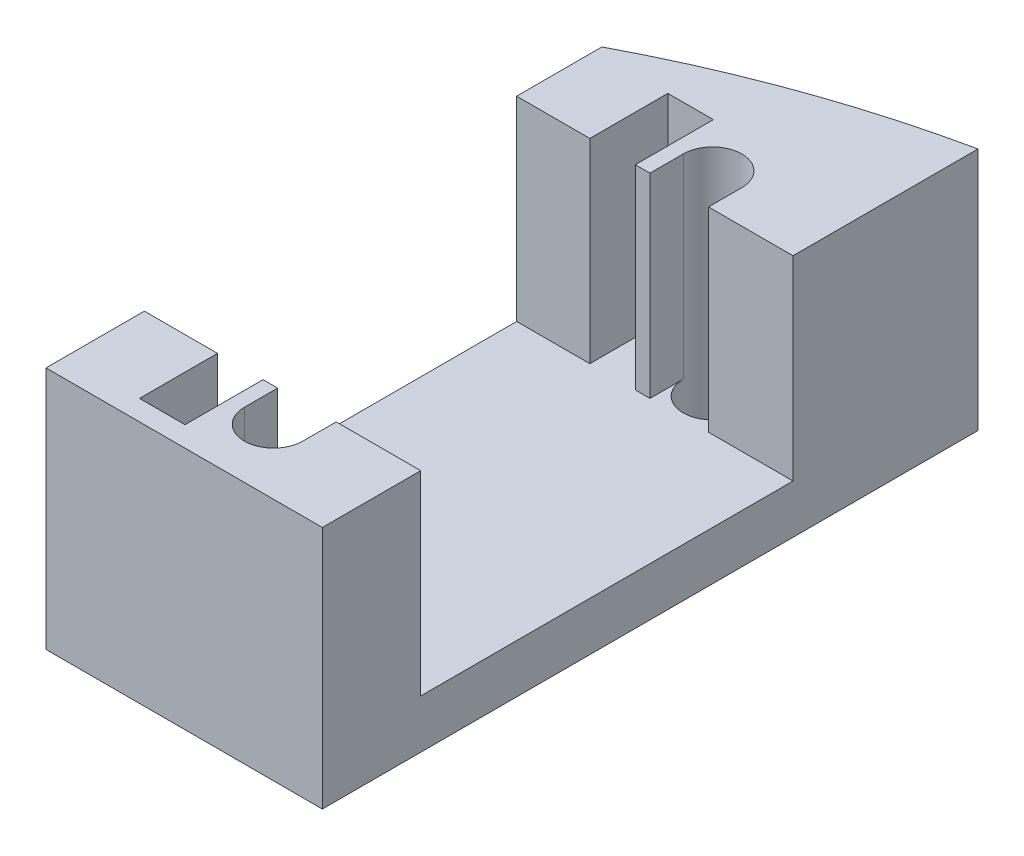
ISO-10303-21;
HEADER;
FILE_DESCRIPTION(('STEP AP214'),'2;1');
FILE_NAME('part.step','',(''),(''),'','','');
FILE_SCHEMA(('AUTOMOTIVE_DESIGN { 1 0 10303 214 1 1 1 1 }'));
ENDSEC;
DATA;
#1=APPLICATION_CONTEXT('core data for automotive mechanical design processes');
#2=APPLICATION_PROTOCOL_DEFINITION('international standard','automotive_design',2000,#1);
#3=PRODUCT_CONTEXT('',#1,'mechanical');
#4=PRODUCT('Part','Part','',(#3));
#5=PRODUCT_RELATED_PRODUCT_CATEGORY('part','',(#4));
#6=PRODUCT_DEFINITION_FORMATION('','',#4);
#7=PRODUCT_DEFINITION_CONTEXT('part definition',#1,'design');
#8=PRODUCT_DEFINITION('design','',#6,#7);
#9=PRODUCT_DEFINITION_SHAPE('','',#8);
#10=(LENGTH_UNIT() NAMED_UNIT(*) SI_UNIT(.MILLI.,.METRE.));
#11=(NAMED_UNIT(*) PLANE_ANGLE_UNIT() SI_UNIT($,.RADIAN.));
#12=(NAMED_UNIT(*) SI_UNIT($,.STERADIAN.) SOLID_ANGLE_UNIT());
#13=UNCERTAINTY_MEASURE_WITH_UNIT(LENGTH_MEASURE(1.E-05),#10,'distance_accuracy_value','');
#14=(GEOMETRIC_REPRESENTATION_CONTEXT(3) GLOBAL_UNCERTAINTY_ASSIGNED_CONTEXT((#13)) GLOBAL_UNIT_ASSIGNED_CONTEXT((#10,
#11,#12)) REPRESENTATION_CONTEXT('',''));
#15=CARTESIAN_POINT('',(0.,0.,0.));
#16=DIRECTION('',(0.,0.,1.));
#17=DIRECTION('',(1.,0.,0.));
#18=AXIS2_PLACEMENT_3D('',#15,#16,#17);
#19=CARTESIAN_POINT('',(5.,3.,17.5));
#20=DIRECTION('',(-1.,0.,0.));
#21=DIRECTION('',(0.,0.,1.));
#22=AXIS2_PLACEMENT_3D('',#19,#20,#21);
#23=PLANE('',#22);
#24=DIRECTION('',(0.,1.,0.));
#25=VECTOR('',#24,1.);
#26=CARTESIAN_POINT('',(5.,0.,-22.8280848463562));
#27=LINE('',#26,#25);
#28=CARTESIAN_POINT('',(5.,15.,-22.8280848463562));
#29=VERTEX_POINT('',#28);
#30=CARTESIAN_POINT('',(5.,0.,-22.8280848463562));
#31=VERTEX_POINT('',#30);
#32=EDGE_CURVE('E200',#29,#31,#27,.F.);
#33=ORIENTED_EDGE('',*,*,#32,.F.);
#34=DIRECTION('',(0.,0.,-1.));
#35=VECTOR('',#34,1.);
#36=CARTESIAN_POINT('',(5.,15.,-17.5));
#37=LINE('',#36,#35);
#38=CARTESIAN_POINT('',(5.,15.,-11.45));
#39=VERTEX_POINT('',#38);
#40=EDGE_CURVE('E210',#39,#29,#37,.T.);
#41=ORIENTED_EDGE('',*,*,#40,.F.);
#42=DIRECTION('',(0.,-1.,0.));
#43=VECTOR('',#42,1.);
#44=CARTESIAN_POINT('',(5.,15.,-11.45));
#45=LINE('',#44,#43);
#46=CARTESIAN_POINT('',(5.,3.,-11.45));
#47=VERTEX_POINT('',#46);
#48=EDGE_CURVE('E387',#39,#47,#45,.T.);
#49=ORIENTED_EDGE('',*,*,#48,.T.);
#50=DIRECTION('',(0.,0.,-1.));
#51=VECTOR('',#50,1.);
#52=CARTESIAN_POINT('',(5.,3.,17.5));
#53=LINE('',#52,#51);
#54=CARTESIAN_POINT('',(5.,3.,11.45));
#55=VERTEX_POINT('',#54);
#56=EDGE_CURVE('E267',#55,#47,#53,.T.);
#57=ORIENTED_EDGE('',*,*,#56,.F.);
#58=DIRECTION('',(0.,-1.,0.));
#59=VECTOR('',#58,1.);
#60=CARTESIAN_POINT('',(5.,15.,11.45));
#61=LINE('',#60,#59);
#62=CARTESIAN_POINT('',(5.,15.,11.45));
#63=VERTEX_POINT('',#62);
#64=EDGE_CURVE('E251',#63,#55,#61,.T.);
#65=ORIENTED_EDGE('',*,*,#64,.F.);
#66=DIRECTION('',(0.,0.,-1.));
#67=VECTOR('',#66,1.);
#68=CARTESIAN_POINT('',(5.,15.,17.5));
#69=LINE('',#68,#67);
#70=CARTESIAN_POINT('',(5.,15.,17.5));
#71=VERTEX_POINT('',#70);
#72=EDGE_CURVE('E228',#71,#63,#69,.T.);
#73=ORIENTED_EDGE('',*,*,#72,.F.);
#74=DIRECTION('',(0.,-1.,0.));
#75=VECTOR('',#74,1.);
#76=CARTESIAN_POINT('',(5.,3.,17.5));
#77=LINE('',#76,#75);
#78=CARTESIAN_POINT('',(5.,0.,17.5));
#79=VERTEX_POINT('',#78);
#80=EDGE_CURVE('E273',#71,#79,#77,.T.);
#81=ORIENTED_EDGE('',*,*,#80,.T.);
#82=DIRECTION('',(0.,0.,-1.));
#83=VECTOR('',#82,1.);
#84=CARTESIAN_POINT('',(5.,0.,17.5));
#85=LINE('',#84,#83);
#86=EDGE_CURVE('E213',#79,#31,#85,.T.);
#87=ORIENTED_EDGE('',*,*,#86,.T.);
#88=EDGE_LOOP('',(#33,#41,#49,#57,#65,#73,#81,#87));
#89=FACE_BOUND('',#88,.T.);
#90=ADVANCED_FACE('F40',(#89),#23,.F.);
#91=CARTESIAN_POINT('',(-12.,3.,17.5));
#92=DIRECTION('',(1.,0.,0.));
#93=DIRECTION('',(0.,0.,-1.));
#94=AXIS2_PLACEMENT_3D('',#91,#92,#93);
#95=PLANE('',#94);
#96=DIRECTION('',(0.,1.,0.));
#97=VECTOR('',#96,1.);
#98=CARTESIAN_POINT('',(-12.,0.,-16.6953821192026));
#99=LINE('',#98,#97);
#100=CARTESIAN_POINT('',(-12.,0.,-16.6953821192026));
#101=VERTEX_POINT('',#100);
#102=CARTESIAN_POINT('',(-12.,15.,-16.6953821192026));
#103=VERTEX_POINT('',#102);
#104=EDGE_CURVE('E54',#101,#103,#99,.T.);
#105=ORIENTED_EDGE('',*,*,#104,.F.);
#106=DIRECTION('',(0.,0.,1.));
#107=VECTOR('',#106,1.);
#108=CARTESIAN_POINT('',(-12.,0.,17.5));
#109=LINE('',#108,#107);
#110=CARTESIAN_POINT('',(-12.,0.,17.5));
#111=VERTEX_POINT('',#110);
#112=EDGE_CURVE('E275',#101,#111,#109,.T.);
#113=ORIENTED_EDGE('',*,*,#112,.T.);
#114=DIRECTION('',(0.,-1.,0.));
#115=VECTOR('',#114,1.);
#116=CARTESIAN_POINT('',(-12.,3.,17.5));
#117=LINE('',#116,#115);
#118=CARTESIAN_POINT('',(-12.,15.,17.5));
#119=VERTEX_POINT('',#118);
#120=EDGE_CURVE('E47',#119,#111,#117,.T.);
#121=ORIENTED_EDGE('',*,*,#120,.F.);
#122=DIRECTION('',(0.,0.,1.));
#123=VECTOR('',#122,1.);
#124=CARTESIAN_POINT('',(-12.,15.,17.5));
#125=LINE('',#124,#123);
#126=CARTESIAN_POINT('',(-12.,15.,11.45));
#127=VERTEX_POINT('',#126);
#128=EDGE_CURVE('E338',#127,#119,#125,.T.);
#129=ORIENTED_EDGE('',*,*,#128,.F.);
#130=DIRECTION('',(0.,-1.,0.));
#131=VECTOR('',#130,1.);
#132=CARTESIAN_POINT('',(-12.,24.4811655401644,11.45));
#133=LINE('',#132,#131);
#134=CARTESIAN_POINT('',(-12.,3.,11.45));
#135=VERTEX_POINT('',#134);
#136=EDGE_CURVE('E305',#127,#135,#133,.T.);
#137=ORIENTED_EDGE('',*,*,#136,.T.);
#138=DIRECTION('',(0.,0.,1.));
#139=VECTOR('',#138,1.);
#140=CARTESIAN_POINT('',(-12.,3.,17.5));
#141=LINE('',#140,#139);
#142=CARTESIAN_POINT('',(-12.,3.,-11.45));
#143=VERTEX_POINT('',#142);
#144=EDGE_CURVE('E270',#143,#135,#141,.T.);
#145=ORIENTED_EDGE('',*,*,#144,.F.);
#146=DIRECTION('',(0.,-1.,0.));
#147=VECTOR('',#146,1.);
#148=CARTESIAN_POINT('',(-12.,24.4811655401644,-11.45));
#149=LINE('',#148,#147);
#150=CARTESIAN_POINT('',(-12.,15.,-11.45));
#151=VERTEX_POINT('',#150);
#152=EDGE_CURVE('E303',#151,#143,#149,.T.);
#153=ORIENTED_EDGE('',*,*,#152,.F.);
#154=DIRECTION('',(0.,0.,1.));
#155=VECTOR('',#154,1.);
#156=CARTESIAN_POINT('',(-12.,15.,-17.5));
#157=LINE('',#156,#155);
#158=EDGE_CURVE('E296',#103,#151,#157,.T.);
#159=ORIENTED_EDGE('',*,*,#158,.F.);
#160=EDGE_LOOP('',(#105,#113,#121,#129,#137,#145,#153,#159));
#161=FACE_BOUND('',#160,.T.);
#162=ADVANCED_FACE('F427',(#161),#95,.F.);
#163=CARTESIAN_POINT('',(0.,0.,0.));
#164=DIRECTION('',(0.,-1.,0.));
#165=DIRECTION('',(0.,0.,-1.));
#166=AXIS2_PLACEMENT_3D('',#163,#164,#165);
#167=PLANE('',#166);
#168=CARTESIAN_POINT('',(-2.,0.,-13.5));
#169=DIRECTION('',(0.,-1.,0.));
#170=DIRECTION('',(0.,0.,-1.));
#171=AXIS2_PLACEMENT_3D('',#168,#169,#170);
#172=CIRCLE('',#171,1.79999999999999);
#173=CARTESIAN_POINT('',(-2.,0.,-15.3));
#174=VERTEX_POINT('',#173);
#175=EDGE_CURVE('E254',#174,#174,#172,.T.);
#176=ORIENTED_EDGE('',*,*,#175,.F.);
#177=EDGE_LOOP('',(#176));
#178=FACE_BOUND('',#177,.T.);
#179=CARTESIAN_POINT('',(-2.,0.,13.5));
#180=DIRECTION('',(0.,-1.,0.));
#181=DIRECTION('',(0.,0.,-1.));
#182=AXIS2_PLACEMENT_3D('',#179,#180,#181);
#183=CIRCLE('',#182,1.79999999999999);
#184=CARTESIAN_POINT('',(-2.,0.,11.7));
#185=VERTEX_POINT('',#184);
#186=EDGE_CURVE('E260',#185,#185,#183,.T.);
#187=ORIENTED_EDGE('',*,*,#186,.F.);
#188=EDGE_LOOP('',(#187));
#189=FACE_BOUND('',#188,.T.);
#190=ORIENTED_EDGE('',*,*,#112,.F.);
#191=CARTESIAN_POINT('',(18.6,0.,41.5));
#192=DIRECTION('',(0.,1.,0.));
#193=DIRECTION('',(0.,0.,1.));
#194=AXIS2_PLACEMENT_3D('',#191,#192,#193);
#195=CIRCLE('',#194,65.75);
#196=EDGE_CURVE('E204',#31,#101,#195,.T.);
#197=ORIENTED_EDGE('',*,*,#196,.F.);
#198=ORIENTED_EDGE('',*,*,#86,.F.);
#199=DIRECTION('',(1.,0.,0.));
#200=VECTOR('',#199,1.);
#201=CARTESIAN_POINT('',(-12.,0.,17.5));
#202=LINE('',#201,#200);
#203=EDGE_CURVE('E271',#111,#79,#202,.T.);
#204=ORIENTED_EDGE('',*,*,#203,.F.);
#205=EDGE_LOOP('',(#190,#197,#198,#204));
#206=FACE_BOUND('',#205,.T.);
#207=ADVANCED_FACE('F288',(#178,#189,#206),#167,.T.);
#208=CARTESIAN_POINT('',(0.,15.,0.));
#209=DIRECTION('',(0.,-1.,0.));
#210=DIRECTION('',(0.,0.,-1.));
#211=AXIS2_PLACEMENT_3D('',#208,#209,#210);
#212=PLANE('',#211);
#213=CARTESIAN_POINT('',(18.6,15.,41.5));
#214=DIRECTION('',(0.,1.,0.));
#215=DIRECTION('',(0.,0.,1.));
#216=AXIS2_PLACEMENT_3D('',#213,#214,#215);
#217=CIRCLE('',#216,65.75);
#218=EDGE_CURVE('E197',#29,#103,#217,.T.);
#219=ORIENTED_EDGE('',*,*,#218,.T.);
#220=ORIENTED_EDGE('',*,*,#158,.T.);
#221=DIRECTION('',(1.,0.,0.));
#222=VECTOR('',#221,1.);
#223=CARTESIAN_POINT('',(-12.,15.,-11.45));
#224=LINE('',#223,#222);
#225=CARTESIAN_POINT('',(-7.5,15.,-11.45));
#226=VERTEX_POINT('',#225);
#227=EDGE_CURVE('E307',#151,#226,#224,.T.);
#228=ORIENTED_EDGE('',*,*,#227,.T.);
#229=DIRECTION('',(0.,0.,-1.));
#230=VECTOR('',#229,1.);
#231=CARTESIAN_POINT('',(-7.5,15.,-16.25));
#232=LINE('',#231,#230);
#233=CARTESIAN_POINT('',(-7.5,15.,-16.25));
#234=VERTEX_POINT('',#233);
#235=EDGE_CURVE('E310',#226,#234,#232,.T.);
#236=ORIENTED_EDGE('',*,*,#235,.T.);
#237=DIRECTION('',(1.,0.,0.));
#238=VECTOR('',#237,1.);
#239=CARTESIAN_POINT('',(-7.5,15.,-16.25));
#240=LINE('',#239,#238);
#241=CARTESIAN_POINT('',(-4.7,15.,-16.25));
#242=VERTEX_POINT('',#241);
#243=EDGE_CURVE('E62',#234,#242,#240,.T.);
#244=ORIENTED_EDGE('',*,*,#243,.T.);
#245=DIRECTION('',(0.,0.,1.));
#246=VECTOR('',#245,1.);
#247=CARTESIAN_POINT('',(-4.7,15.,-17.5));
#248=LINE('',#247,#246);
#249=CARTESIAN_POINT('',(-4.7,15.,-11.45));
#250=VERTEX_POINT('',#249);
#251=EDGE_CURVE('E220',#242,#250,#248,.T.);
#252=ORIENTED_EDGE('',*,*,#251,.T.);
#253=DIRECTION('',(1.,0.,0.));
#254=VECTOR('',#253,1.);
#255=CARTESIAN_POINT('',(5.,15.,-11.45));
#256=LINE('',#255,#254);
#257=CARTESIAN_POINT('',(-3.8,15.,-11.45));
#258=VERTEX_POINT('',#257);
#259=EDGE_CURVE('E224',#250,#258,#256,.T.);
#260=ORIENTED_EDGE('',*,*,#259,.T.);
#261=DIRECTION('',(0.,0.,1.));
#262=VECTOR('',#261,1.);
#263=CARTESIAN_POINT('',(-3.8,15.,13.5));
#264=LINE('',#263,#262);
#265=CARTESIAN_POINT('',(-3.8,15.,-13.5));
#266=VERTEX_POINT('',#265);
#267=EDGE_CURVE('E363',#266,#258,#264,.T.);
#268=ORIENTED_EDGE('',*,*,#267,.F.);
#269=CARTESIAN_POINT('',(-2.,15.,-13.5));
#270=DIRECTION('',(0.,1.,0.));
#271=DIRECTION('',(0.,0.,1.));
#272=AXIS2_PLACEMENT_3D('',#269,#270,#271);
#273=CIRCLE('',#272,1.8);
#274=CARTESIAN_POINT('',(-0.200000000000002,15.,-13.5));
#275=VERTEX_POINT('',#274);
#276=EDGE_CURVE('E359',#275,#266,#273,.T.);
#277=ORIENTED_EDGE('',*,*,#276,.F.);
#278=DIRECTION('',(0.,0.,1.));
#279=VECTOR('',#278,1.);
#280=CARTESIAN_POINT('',(-0.200000000000005,15.,0.));
#281=LINE('',#280,#279);
#282=CARTESIAN_POINT('',(-0.200000000000005,15.,-11.45));
#283=VERTEX_POINT('',#282);
#284=EDGE_CURVE('E12',#275,#283,#281,.T.);
#285=ORIENTED_EDGE('',*,*,#284,.T.);
#286=EDGE_CURVE('E217',#283,#39,#256,.T.);
#287=ORIENTED_EDGE('',*,*,#286,.T.);
#288=ORIENTED_EDGE('',*,*,#40,.T.);
#289=EDGE_LOOP('',(#219,#220,#228,#236,#244,#252,#260,#268,#277,#285,#287,#288));
#290=FACE_BOUND('',#289,.T.);
#291=ADVANCED_FACE('F215',(#290),#212,.F.);
#292=CARTESIAN_POINT('',(0.,3.,0.));
#293=DIRECTION('',(0.,-1.,0.));
#294=DIRECTION('',(0.,0.,-1.));
#295=AXIS2_PLACEMENT_3D('',#292,#293,#294);
#296=PLANE('',#295);
#297=DIRECTION('',(1.,0.,0.));
#298=VECTOR('',#297,1.);
#299=CARTESIAN_POINT('',(-12.,3.,-11.45));
#300=LINE('',#299,#298);
#301=CARTESIAN_POINT('',(-7.5,3.,-11.45));
#302=VERTEX_POINT('',#301);
#303=EDGE_CURVE('E302',#143,#302,#300,.T.);
#304=ORIENTED_EDGE('',*,*,#303,.F.);
#305=ORIENTED_EDGE('',*,*,#144,.T.);
#306=DIRECTION('',(-1.,0.,0.));
#307=VECTOR('',#306,1.);
#308=CARTESIAN_POINT('',(-12.,3.,11.45));
#309=LINE('',#308,#307);
#310=CARTESIAN_POINT('',(-7.50000000000001,3.,11.45));
#311=VERTEX_POINT('',#310);
#312=EDGE_CURVE('E318',#311,#135,#309,.T.);
#313=ORIENTED_EDGE('',*,*,#312,.F.);
#314=DIRECTION('',(0.,0.,-1.));
#315=VECTOR('',#314,1.);
#316=CARTESIAN_POINT('',(-7.50000000000001,3.,16.25));
#317=LINE('',#316,#315);
#318=CARTESIAN_POINT('',(-7.50000000000001,3.,16.25));
#319=VERTEX_POINT('',#318);
#320=EDGE_CURVE('E323',#319,#311,#317,.T.);
#321=ORIENTED_EDGE('',*,*,#320,.F.);
#322=DIRECTION('',(-1.,0.,0.));
#323=VECTOR('',#322,1.);
#324=CARTESIAN_POINT('',(-7.50000000000001,3.,16.25));
#325=LINE('',#324,#323);
#326=CARTESIAN_POINT('',(-4.7,3.,16.25));
#327=VERTEX_POINT('',#326);
#328=EDGE_CURVE('E327',#327,#319,#325,.T.);
#329=ORIENTED_EDGE('',*,*,#328,.F.);
#330=DIRECTION('',(0.,0.,1.));
#331=VECTOR('',#330,1.);
#332=CARTESIAN_POINT('',(-4.7,3.,17.5));
#333=LINE('',#332,#331);
#334=CARTESIAN_POINT('',(-4.7,3.,11.45));
#335=VERTEX_POINT('',#334);
#336=EDGE_CURVE('E232',#335,#327,#333,.T.);
#337=ORIENTED_EDGE('',*,*,#336,.F.);
#338=DIRECTION('',(-1.,0.,0.));
#339=VECTOR('',#338,1.);
#340=CARTESIAN_POINT('',(5.,3.,11.45));
#341=LINE('',#340,#339);
#342=CARTESIAN_POINT('',(-3.8,3.,11.45));
#343=VERTEX_POINT('',#342);
#344=EDGE_CURVE('E246',#343,#335,#341,.T.);
#345=ORIENTED_EDGE('',*,*,#344,.F.);
#346=DIRECTION('',(0.,0.,1.));
#347=VECTOR('',#346,1.);
#348=CARTESIAN_POINT('',(-3.8,3.,13.5));
#349=LINE('',#348,#347);
#350=CARTESIAN_POINT('',(-3.8,3.,13.5));
#351=VERTEX_POINT('',#350);
#352=EDGE_CURVE('E349',#343,#351,#349,.T.);
#353=ORIENTED_EDGE('',*,*,#352,.T.);
#354=CARTESIAN_POINT('',(-2.,3.,13.5));
#355=DIRECTION('',(0.,-1.,0.));
#356=DIRECTION('',(0.,0.,-1.));
#357=AXIS2_PLACEMENT_3D('',#354,#355,#356);
#358=CIRCLE('',#357,1.8);
#359=CARTESIAN_POINT('',(-0.200000000000005,3.,13.5));
#360=VERTEX_POINT('',#359);
#361=EDGE_CURVE('E263',#351,#360,#358,.T.);
#362=ORIENTED_EDGE('',*,*,#361,.T.);
#363=DIRECTION('',(0.,0.,-1.));
#364=VECTOR('',#363,1.);
#365=CARTESIAN_POINT('',(-0.200000000000005,3.,13.5));
#366=LINE('',#365,#364);
#367=CARTESIAN_POINT('',(-0.200000000000001,3.,11.45));
#368=VERTEX_POINT('',#367);
#369=EDGE_CURVE('E347',#360,#368,#366,.T.);
#370=ORIENTED_EDGE('',*,*,#369,.T.);
#371=EDGE_CURVE('E243',#55,#368,#341,.T.);
#372=ORIENTED_EDGE('',*,*,#371,.F.);
#373=ORIENTED_EDGE('',*,*,#56,.T.);
#374=DIRECTION('',(1.,0.,0.));
#375=VECTOR('',#374,1.);
#376=CARTESIAN_POINT('',(5.,3.,-11.45));
#377=LINE('',#376,#375);
#378=CARTESIAN_POINT('',(-0.200000000000005,3.,-11.45));
#379=VERTEX_POINT('',#378);
#380=EDGE_CURVE('E219',#379,#47,#377,.T.);
#381=ORIENTED_EDGE('',*,*,#380,.F.);
#382=CARTESIAN_POINT('',(-0.200000000000002,3.,-13.5));
#383=VERTEX_POINT('',#382);
#384=EDGE_CURVE('E350',#379,#383,#366,.T.);
#385=ORIENTED_EDGE('',*,*,#384,.T.);
#386=CARTESIAN_POINT('',(-2.,3.,-13.5));
#387=DIRECTION('',(0.,-1.,0.));
#388=DIRECTION('',(0.,0.,-1.));
#389=AXIS2_PLACEMENT_3D('',#386,#387,#388);
#390=CIRCLE('',#389,1.8);
#391=CARTESIAN_POINT('',(-3.8,3.,-13.5));
#392=VERTEX_POINT('',#391);
#393=EDGE_CURVE('E257',#383,#392,#390,.T.);
#394=ORIENTED_EDGE('',*,*,#393,.T.);
#395=CARTESIAN_POINT('',(-3.8,3.,-11.45));
#396=VERTEX_POINT('',#395);
#397=EDGE_CURVE('E351',#392,#396,#349,.T.);
#398=ORIENTED_EDGE('',*,*,#397,.T.);
#399=CARTESIAN_POINT('',(-4.7,3.,-11.45));
#400=VERTEX_POINT('',#399);
#401=EDGE_CURVE('E222',#400,#396,#377,.T.);
#402=ORIENTED_EDGE('',*,*,#401,.F.);
#403=DIRECTION('',(0.,0.,1.));
#404=VECTOR('',#403,1.);
#405=CARTESIAN_POINT('',(-4.7,3.,-17.5));
#406=LINE('',#405,#404);
#407=CARTESIAN_POINT('',(-4.7,3.,-16.25));
#408=VERTEX_POINT('',#407);
#409=EDGE_CURVE('E390',#408,#400,#406,.T.);
#410=ORIENTED_EDGE('',*,*,#409,.F.);
#411=DIRECTION('',(1.,0.,0.));
#412=VECTOR('',#411,1.);
#413=CARTESIAN_POINT('',(-7.5,3.,-16.25));
#414=LINE('',#413,#412);
#415=CARTESIAN_POINT('',(-7.5,3.,-16.25));
#416=VERTEX_POINT('',#415);
#417=EDGE_CURVE('E295',#416,#408,#414,.T.);
#418=ORIENTED_EDGE('',*,*,#417,.F.);
#419=DIRECTION('',(0.,0.,-1.));
#420=VECTOR('',#419,1.);
#421=CARTESIAN_POINT('',(-7.5,3.,-16.25));
#422=LINE('',#421,#420);
#423=EDGE_CURVE('E299',#302,#416,#422,.T.);
#424=ORIENTED_EDGE('',*,*,#423,.F.);
#425=EDGE_LOOP('',(#304,#305,#313,#321,#329,#337,#345,#353,#362,#370,#372,#373,#381,#385,#394,
#398,#402,#410,#418,#424));
#426=FACE_BOUND('',#425,.T.);
#427=ADVANCED_FACE('F405',(#426),#296,.F.);
#428=CARTESIAN_POINT('',(-4.7,15.,-17.5));
#429=DIRECTION('',(1.,0.,0.));
#430=DIRECTION('',(0.,0.,-1.));
#431=AXIS2_PLACEMENT_3D('',#428,#429,#430);
#432=PLANE('',#431);
#433=DIRECTION('',(0.,-1.,0.));
#434=VECTOR('',#433,1.);
#435=CARTESIAN_POINT('',(-4.7,24.4811655401644,-16.25));
#436=LINE('',#435,#434);
#437=EDGE_CURVE('E292',#242,#408,#436,.T.);
#438=ORIENTED_EDGE('',*,*,#437,.T.);
#439=ORIENTED_EDGE('',*,*,#409,.T.);
#440=DIRECTION('',(0.,-1.,0.));
#441=VECTOR('',#440,1.);
#442=CARTESIAN_POINT('',(-4.7,15.,-11.45));
#443=LINE('',#442,#441);
#444=EDGE_CURVE('E265',#250,#400,#443,.T.);
#445=ORIENTED_EDGE('',*,*,#444,.F.);
#446=ORIENTED_EDGE('',*,*,#251,.F.);
#447=EDGE_LOOP('',(#438,#439,#445,#446));
#448=FACE_BOUND('',#447,.T.);
#449=ADVANCED_FACE('F447',(#448),#432,.F.);
#450=CARTESIAN_POINT('',(-4.7,15.,17.5));
#451=DIRECTION('',(1.,0.,0.));
#452=DIRECTION('',(0.,0.,-1.));
#453=AXIS2_PLACEMENT_3D('',#450,#451,#452);
#454=PLANE('',#453);
#455=DIRECTION('',(0.,-1.,0.));
#456=VECTOR('',#455,1.);
#457=CARTESIAN_POINT('',(-4.7,24.4811655401644,16.25));
#458=LINE('',#457,#456);
#459=CARTESIAN_POINT('',(-4.7,15.,16.25));
#460=VERTEX_POINT('',#459);
#461=EDGE_CURVE('E330',#460,#327,#458,.T.);
#462=ORIENTED_EDGE('',*,*,#461,.F.);
#463=DIRECTION('',(0.,0.,1.));
#464=VECTOR('',#463,1.);
#465=CARTESIAN_POINT('',(-4.7,15.,17.5));
#466=LINE('',#465,#464);
#467=CARTESIAN_POINT('',(-4.7,15.,11.45));
#468=VERTEX_POINT('',#467);
#469=EDGE_CURVE('E236',#468,#460,#466,.T.);
#470=ORIENTED_EDGE('',*,*,#469,.F.);
#471=DIRECTION('',(0.,-1.,0.));
#472=VECTOR('',#471,1.);
#473=CARTESIAN_POINT('',(-4.7,15.,11.45));
#474=LINE('',#473,#472);
#475=EDGE_CURVE('E242',#468,#335,#474,.T.);
#476=ORIENTED_EDGE('',*,*,#475,.T.);
#477=ORIENTED_EDGE('',*,*,#336,.T.);
#478=EDGE_LOOP('',(#462,#470,#476,#477));
#479=FACE_BOUND('',#478,.T.);
#480=ADVANCED_FACE('F449',(#479),#454,.F.);
#481=CARTESIAN_POINT('',(5.,15.,11.45));
#482=DIRECTION('',(0.,0.,1.));
#483=DIRECTION('',(1.,0.,0.));
#484=AXIS2_PLACEMENT_3D('',#481,#482,#483);
#485=PLANE('',#484);
#486=DIRECTION('',(-1.,0.,0.));
#487=VECTOR('',#486,1.);
#488=CARTESIAN_POINT('',(5.,15.,11.45));
#489=LINE('',#488,#487);
#490=CARTESIAN_POINT('',(-3.8,15.,11.45));
#491=VERTEX_POINT('',#490);
#492=EDGE_CURVE('E231',#491,#468,#489,.T.);
#493=ORIENTED_EDGE('',*,*,#492,.F.);
#494=DIRECTION('',(0.,-1.,0.));
#495=VECTOR('',#494,1.);
#496=CARTESIAN_POINT('',(-3.8,15.,11.45));
#497=LINE('',#496,#495);
#498=EDGE_CURVE('E266',#491,#343,#497,.T.);
#499=ORIENTED_EDGE('',*,*,#498,.T.);
#500=ORIENTED_EDGE('',*,*,#344,.T.);
#501=ORIENTED_EDGE('',*,*,#475,.F.);
#502=EDGE_LOOP('',(#493,#499,#500,#501));
#503=FACE_BOUND('',#502,.T.);
#504=ADVANCED_FACE('F455',(#503),#485,.F.);
#505=CARTESIAN_POINT('',(5.,15.,-11.45));
#506=DIRECTION('',(0.,0.,-1.));
#507=DIRECTION('',(-1.,0.,0.));
#508=AXIS2_PLACEMENT_3D('',#505,#506,#507);
#509=PLANE('',#508);
#510=ORIENTED_EDGE('',*,*,#401,.T.);
#511=DIRECTION('',(0.,1.,0.));
#512=VECTOR('',#511,1.);
#513=CARTESIAN_POINT('',(-3.8,15.,-11.45));
#514=LINE('',#513,#512);
#515=EDGE_CURVE('E380',#396,#258,#514,.T.);
#516=ORIENTED_EDGE('',*,*,#515,.T.);
#517=ORIENTED_EDGE('',*,*,#259,.F.);
#518=ORIENTED_EDGE('',*,*,#444,.T.);
#519=EDGE_LOOP('',(#510,#516,#517,#518));
#520=FACE_BOUND('',#519,.T.);
#521=ADVANCED_FACE('F398',(#520),#509,.F.);
#522=CARTESIAN_POINT('',(-12.,3.,17.5));
#523=DIRECTION('',(0.,0.,-1.));
#524=DIRECTION('',(-1.,0.,0.));
#525=AXIS2_PLACEMENT_3D('',#522,#523,#524);
#526=PLANE('',#525);
#527=ORIENTED_EDGE('',*,*,#203,.T.);
#528=ORIENTED_EDGE('',*,*,#80,.F.);
#529=DIRECTION('',(1.,0.,0.));
#530=VECTOR('',#529,1.);
#531=CARTESIAN_POINT('',(5.,15.,17.5));
#532=LINE('',#531,#530);
#533=EDGE_CURVE('E239',#119,#71,#532,.T.);
#534=ORIENTED_EDGE('',*,*,#533,.F.);
#535=ORIENTED_EDGE('',*,*,#120,.T.);
#536=EDGE_LOOP('',(#527,#528,#534,#535));
#537=FACE_BOUND('',#536,.T.);
#538=ADVANCED_FACE('F282',(#537),#526,.F.);
#539=CARTESIAN_POINT('',(-2.,0.,13.5));
#540=DIRECTION('',(0.,-1.,0.));
#541=DIRECTION('',(0.,0.,-1.));
#542=AXIS2_PLACEMENT_3D('',#539,#540,#541);
#543=CYLINDRICAL_SURFACE('',#542,1.79999999999999);
#544=ORIENTED_EDGE('',*,*,#361,.F.);
#545=DIRECTION('',(0.,1.,0.));
#546=VECTOR('',#545,1.);
#547=CARTESIAN_POINT('',(-3.8,3.,13.5));
#548=LINE('',#547,#546);
#549=CARTESIAN_POINT('',(-3.8,15.,13.5));
#550=VERTEX_POINT('',#549);
#551=EDGE_CURVE('E365',#351,#550,#548,.T.);
#552=ORIENTED_EDGE('',*,*,#551,.T.);
#553=CARTESIAN_POINT('',(-2.,15.,13.5));
#554=DIRECTION('',(0.,1.,0.));
#555=DIRECTION('',(0.,0.,1.));
#556=AXIS2_PLACEMENT_3D('',#553,#554,#555);
#557=CIRCLE('',#556,1.8);
#558=CARTESIAN_POINT('',(-0.200000000000005,15.,13.5));
#559=VERTEX_POINT('',#558);
#560=EDGE_CURVE('E334',#550,#559,#557,.T.);
#561=ORIENTED_EDGE('',*,*,#560,.T.);
#562=DIRECTION('',(0.,1.,0.));
#563=VECTOR('',#562,1.);
#564=CARTESIAN_POINT('',(-0.200000000000005,3.,13.5));
#565=LINE('',#564,#563);
#566=EDGE_CURVE('E354',#360,#559,#565,.T.);
#567=ORIENTED_EDGE('',*,*,#566,.F.);
#568=EDGE_LOOP('',(#544,#552,#561,#567));
#569=FACE_BOUND('',#568,.T.);
#570=ORIENTED_EDGE('',*,*,#186,.T.);
#571=EDGE_LOOP('',(#570));
#572=FACE_BOUND('',#571,.T.);
#573=ADVANCED_FACE('F473',(#569,#572),#543,.F.);
#574=CARTESIAN_POINT('',(-2.,0.,-13.5));
#575=DIRECTION('',(0.,-1.,0.));
#576=DIRECTION('',(0.,0.,-1.));
#577=AXIS2_PLACEMENT_3D('',#574,#575,#576);
#578=CYLINDRICAL_SURFACE('',#577,1.79999999999999);
#579=ORIENTED_EDGE('',*,*,#393,.F.);
#580=DIRECTION('',(0.,1.,0.));
#581=VECTOR('',#580,1.);
#582=CARTESIAN_POINT('',(-0.200000000000002,3.,-13.5));
#583=LINE('',#582,#581);
#584=EDGE_CURVE('E371',#383,#275,#583,.T.);
#585=ORIENTED_EDGE('',*,*,#584,.T.);
#586=ORIENTED_EDGE('',*,*,#276,.T.);
#587=DIRECTION('',(0.,1.,0.));
#588=VECTOR('',#587,1.);
#589=CARTESIAN_POINT('',(-3.8,3.,-13.5));
#590=LINE('',#589,#588);
#591=EDGE_CURVE('E369',#392,#266,#590,.T.);
#592=ORIENTED_EDGE('',*,*,#591,.F.);
#593=EDGE_LOOP('',(#579,#585,#586,#592));
#594=FACE_BOUND('',#593,.T.);
#595=ORIENTED_EDGE('',*,*,#175,.T.);
#596=EDGE_LOOP('',(#595));
#597=FACE_BOUND('',#596,.T.);
#598=ADVANCED_FACE('F411',(#594,#597),#578,.F.);
#599=CARTESIAN_POINT('',(0.,15.,0.));
#600=DIRECTION('',(0.,1.,0.));
#601=DIRECTION('',(0.,0.,1.));
#602=AXIS2_PLACEMENT_3D('',#599,#600,#601);
#603=PLANE('',#602);
#604=EDGE_CURVE('E362',#491,#550,#264,.T.);
#605=ORIENTED_EDGE('',*,*,#604,.F.);
#606=ORIENTED_EDGE('',*,*,#492,.T.);
#607=ORIENTED_EDGE('',*,*,#469,.T.);
#608=DIRECTION('',(-1.,0.,0.));
#609=VECTOR('',#608,1.);
#610=CARTESIAN_POINT('',(-7.50000000000001,15.,16.25));
#611=LINE('',#610,#609);
#612=CARTESIAN_POINT('',(-7.50000000000001,15.,16.25));
#613=VERTEX_POINT('',#612);
#614=EDGE_CURVE('E335',#460,#613,#611,.T.);
#615=ORIENTED_EDGE('',*,*,#614,.T.);
#616=DIRECTION('',(0.,0.,-1.));
#617=VECTOR('',#616,1.);
#618=CARTESIAN_POINT('',(-7.50000000000001,15.,16.25));
#619=LINE('',#618,#617);
#620=CARTESIAN_POINT('',(-7.50000000000001,15.,11.45));
#621=VERTEX_POINT('',#620);
#622=EDGE_CURVE('E331',#613,#621,#619,.T.);
#623=ORIENTED_EDGE('',*,*,#622,.T.);
#624=DIRECTION('',(-1.,0.,0.));
#625=VECTOR('',#624,1.);
#626=CARTESIAN_POINT('',(-12.,15.,11.45));
#627=LINE('',#626,#625);
#628=EDGE_CURVE('E321',#621,#127,#627,.T.);
#629=ORIENTED_EDGE('',*,*,#628,.T.);
#630=ORIENTED_EDGE('',*,*,#128,.T.);
#631=ORIENTED_EDGE('',*,*,#533,.T.);
#632=ORIENTED_EDGE('',*,*,#72,.T.);
#633=CARTESIAN_POINT('',(-0.200000000000005,15.,11.45));
#634=VERTEX_POINT('',#633);
#635=EDGE_CURVE('E233',#63,#634,#489,.T.);
#636=ORIENTED_EDGE('',*,*,#635,.T.);
#637=DIRECTION('',(0.,0.,-1.));
#638=VECTOR('',#637,1.);
#639=CARTESIAN_POINT('',(-0.200000000000005,15.,13.5));
#640=LINE('',#639,#638);
#641=EDGE_CURVE('E357',#559,#634,#640,.T.);
#642=ORIENTED_EDGE('',*,*,#641,.F.);
#643=ORIENTED_EDGE('',*,*,#560,.F.);
#644=EDGE_LOOP('',(#605,#606,#607,#615,#623,#629,#630,#631,#632,#636,#642,#643));
#645=FACE_BOUND('',#644,.T.);
#646=ADVANCED_FACE('F425',(#645),#603,.T.);
#647=ORIENTED_EDGE('',*,*,#371,.T.);
#648=DIRECTION('',(0.,1.,0.));
#649=VECTOR('',#648,1.);
#650=CARTESIAN_POINT('',(-0.200000000000005,15.,11.45));
#651=LINE('',#650,#649);
#652=EDGE_CURVE('E377',#368,#634,#651,.T.);
#653=ORIENTED_EDGE('',*,*,#652,.T.);
#654=ORIENTED_EDGE('',*,*,#635,.F.);
#655=ORIENTED_EDGE('',*,*,#64,.T.);
#656=EDGE_LOOP('',(#647,#653,#654,#655));
#657=FACE_BOUND('',#656,.T.);
#658=ADVANCED_FACE('F420',(#657),#485,.F.);
#659=ORIENTED_EDGE('',*,*,#286,.F.);
#660=DIRECTION('',(0.,-1.,0.));
#661=VECTOR('',#660,1.);
#662=CARTESIAN_POINT('',(-0.200000000000005,15.,-11.45));
#663=LINE('',#662,#661);
#664=EDGE_CURVE('E368',#283,#379,#663,.T.);
#665=ORIENTED_EDGE('',*,*,#664,.T.);
#666=ORIENTED_EDGE('',*,*,#380,.T.);
#667=ORIENTED_EDGE('',*,*,#48,.F.);
#668=EDGE_LOOP('',(#659,#665,#666,#667));
#669=FACE_BOUND('',#668,.T.);
#670=ADVANCED_FACE('F415',(#669),#509,.F.);
#671=CARTESIAN_POINT('',(-0.200000000000005,3.,13.5));
#672=DIRECTION('',(1.,0.,0.));
#673=DIRECTION('',(0.,0.,-1.));
#674=AXIS2_PLACEMENT_3D('',#671,#672,#673);
#675=PLANE('',#674);
#676=ORIENTED_EDGE('',*,*,#284,.F.);
#677=ORIENTED_EDGE('',*,*,#584,.F.);
#678=ORIENTED_EDGE('',*,*,#384,.F.);
#679=ORIENTED_EDGE('',*,*,#664,.F.);
#680=EDGE_LOOP('',(#676,#677,#678,#679));
#681=FACE_BOUND('',#680,.T.);
#682=ADVANCED_FACE('F486',(#681),#675,.F.);
#683=CARTESIAN_POINT('',(-3.8,3.,13.5));
#684=DIRECTION('',(-1.,0.,0.));
#685=DIRECTION('',(0.,0.,1.));
#686=AXIS2_PLACEMENT_3D('',#683,#684,#685);
#687=PLANE('',#686);
#688=ORIENTED_EDGE('',*,*,#397,.F.);
#689=ORIENTED_EDGE('',*,*,#591,.T.);
#690=ORIENTED_EDGE('',*,*,#267,.T.);
#691=ORIENTED_EDGE('',*,*,#515,.F.);
#692=EDGE_LOOP('',(#688,#689,#690,#691));
#693=FACE_BOUND('',#692,.T.);
#694=ADVANCED_FACE('F401',(#693),#687,.F.);
#695=ORIENTED_EDGE('',*,*,#604,.T.);
#696=ORIENTED_EDGE('',*,*,#551,.F.);
#697=ORIENTED_EDGE('',*,*,#352,.F.);
#698=ORIENTED_EDGE('',*,*,#498,.F.);
#699=EDGE_LOOP('',(#695,#696,#697,#698));
#700=FACE_BOUND('',#699,.T.);
#701=ADVANCED_FACE('F504',(#700),#687,.F.);
#702=ORIENTED_EDGE('',*,*,#369,.F.);
#703=ORIENTED_EDGE('',*,*,#566,.T.);
#704=ORIENTED_EDGE('',*,*,#641,.T.);
#705=ORIENTED_EDGE('',*,*,#652,.F.);
#706=EDGE_LOOP('',(#702,#703,#704,#705));
#707=FACE_BOUND('',#706,.T.);
#708=ADVANCED_FACE('F490',(#707),#675,.F.);
#709=CARTESIAN_POINT('',(-7.50000000000001,24.4811655401644,16.25));
#710=DIRECTION('',(0.,0.,1.));
#711=DIRECTION('',(1.,0.,0.));
#712=AXIS2_PLACEMENT_3D('',#709,#710,#711);
#713=PLANE('',#712);
#714=ORIENTED_EDGE('',*,*,#614,.F.);
#715=ORIENTED_EDGE('',*,*,#461,.T.);
#716=ORIENTED_EDGE('',*,*,#328,.T.);
#717=DIRECTION('',(0.,-1.,0.));
#718=VECTOR('',#717,1.);
#719=CARTESIAN_POINT('',(-7.50000000000001,24.4811655401644,16.25));
#720=LINE('',#719,#718);
#721=EDGE_CURVE('E326',#613,#319,#720,.T.);
#722=ORIENTED_EDGE('',*,*,#721,.F.);
#723=EDGE_LOOP('',(#714,#715,#716,#722));
#724=FACE_BOUND('',#723,.T.);
#725=ADVANCED_FACE('F513',(#724),#713,.F.);
#726=CARTESIAN_POINT('',(-7.50000000000001,24.4811655401644,16.25));
#727=DIRECTION('',(-1.,0.,0.));
#728=DIRECTION('',(0.,0.,1.));
#729=AXIS2_PLACEMENT_3D('',#726,#727,#728);
#730=PLANE('',#729);
#731=ORIENTED_EDGE('',*,*,#622,.F.);
#732=ORIENTED_EDGE('',*,*,#721,.T.);
#733=ORIENTED_EDGE('',*,*,#320,.T.);
#734=DIRECTION('',(0.,-1.,0.));
#735=VECTOR('',#734,1.);
#736=CARTESIAN_POINT('',(-7.50000000000001,24.4811655401644,11.45));
#737=LINE('',#736,#735);
#738=EDGE_CURVE('E322',#621,#311,#737,.T.);
#739=ORIENTED_EDGE('',*,*,#738,.F.);
#740=EDGE_LOOP('',(#731,#732,#733,#739));
#741=FACE_BOUND('',#740,.T.);
#742=ADVANCED_FACE('F516',(#741),#730,.F.);
#743=CARTESIAN_POINT('',(-12.,24.4811655401644,11.45));
#744=DIRECTION('',(0.,0.,1.));
#745=DIRECTION('',(1.,0.,0.));
#746=AXIS2_PLACEMENT_3D('',#743,#744,#745);
#747=PLANE('',#746);
#748=ORIENTED_EDGE('',*,*,#628,.F.);
#749=ORIENTED_EDGE('',*,*,#738,.T.);
#750=ORIENTED_EDGE('',*,*,#312,.T.);
#751=ORIENTED_EDGE('',*,*,#136,.F.);
#752=EDGE_LOOP('',(#748,#749,#750,#751));
#753=FACE_BOUND('',#752,.T.);
#754=ADVANCED_FACE('F432',(#753),#747,.F.);
#755=CARTESIAN_POINT('',(-12.,24.4811655401644,-11.45));
#756=DIRECTION('',(0.,0.,-1.));
#757=DIRECTION('',(-1.,0.,0.));
#758=AXIS2_PLACEMENT_3D('',#755,#756,#757);
#759=PLANE('',#758);
#760=ORIENTED_EDGE('',*,*,#227,.F.);
#761=ORIENTED_EDGE('',*,*,#152,.T.);
#762=ORIENTED_EDGE('',*,*,#303,.T.);
#763=DIRECTION('',(0.,-1.,0.));
#764=VECTOR('',#763,1.);
#765=CARTESIAN_POINT('',(-7.5,24.4811655401644,-11.45));
#766=LINE('',#765,#764);
#767=EDGE_CURVE('E300',#226,#302,#766,.T.);
#768=ORIENTED_EDGE('',*,*,#767,.F.);
#769=EDGE_LOOP('',(#760,#761,#762,#768));
#770=FACE_BOUND('',#769,.T.);
#771=ADVANCED_FACE('F440',(#770),#759,.F.);
#772=CARTESIAN_POINT('',(-7.5,24.4811655401644,-16.25));
#773=DIRECTION('',(-1.,0.,0.));
#774=DIRECTION('',(0.,0.,1.));
#775=AXIS2_PLACEMENT_3D('',#772,#773,#774);
#776=PLANE('',#775);
#777=ORIENTED_EDGE('',*,*,#235,.F.);
#778=ORIENTED_EDGE('',*,*,#767,.T.);
#779=ORIENTED_EDGE('',*,*,#423,.T.);
#780=DIRECTION('',(0.,-1.,0.));
#781=VECTOR('',#780,1.);
#782=CARTESIAN_POINT('',(-7.5,24.4811655401644,-16.25));
#783=LINE('',#782,#781);
#784=EDGE_CURVE('E297',#234,#416,#783,.T.);
#785=ORIENTED_EDGE('',*,*,#784,.F.);
#786=EDGE_LOOP('',(#777,#778,#779,#785));
#787=FACE_BOUND('',#786,.T.);
#788=ADVANCED_FACE('F443',(#787),#776,.F.);
#789=CARTESIAN_POINT('',(-7.5,24.4811655401644,-16.25));
#790=DIRECTION('',(0.,0.,-1.));
#791=DIRECTION('',(-1.,0.,0.));
#792=AXIS2_PLACEMENT_3D('',#789,#790,#791);
#793=PLANE('',#792);
#794=ORIENTED_EDGE('',*,*,#243,.F.);
#795=ORIENTED_EDGE('',*,*,#784,.T.);
#796=ORIENTED_EDGE('',*,*,#417,.T.);
#797=ORIENTED_EDGE('',*,*,#437,.F.);
#798=EDGE_LOOP('',(#794,#795,#796,#797));
#799=FACE_BOUND('',#798,.T.);
#800=ADVANCED_FACE('F445',(#799),#793,.F.);
#801=CARTESIAN_POINT('',(18.6,0.,41.5));
#802=DIRECTION('',(0.,1.,0.));
#803=DIRECTION('',(0.,0.,1.));
#804=AXIS2_PLACEMENT_3D('',#801,#802,#803);
#805=CYLINDRICAL_SURFACE('',#804,65.75);
#806=ORIENTED_EDGE('',*,*,#32,.T.);
#807=ORIENTED_EDGE('',*,*,#196,.T.);
#808=ORIENTED_EDGE('',*,*,#104,.T.);
#809=ORIENTED_EDGE('',*,*,#218,.F.);
#810=EDGE_LOOP('',(#806,#807,#808,#809));
#811=FACE_BOUND('',#810,.T.);
#812=ADVANCED_FACE('F199',(#811),#805,.T.);
#813=CLOSED_SHELL('',(#90,#162,#207,#291,#427,#449,#480,#504,#521,#538,#573,#598,#646,#658,#670,
#682,#694,#701,#708,#725,#742,#754,#771,#788,#800,#812));
#814=MANIFOLD_SOLID_BREP('B2',#813);
#815=ADVANCED_BREP_SHAPE_REPRESENTATION('',(#18,#814),#14);
#816=SHAPE_DEFINITION_REPRESENTATION(#9,#815);
ENDSEC;
END-ISO-10303-21;
